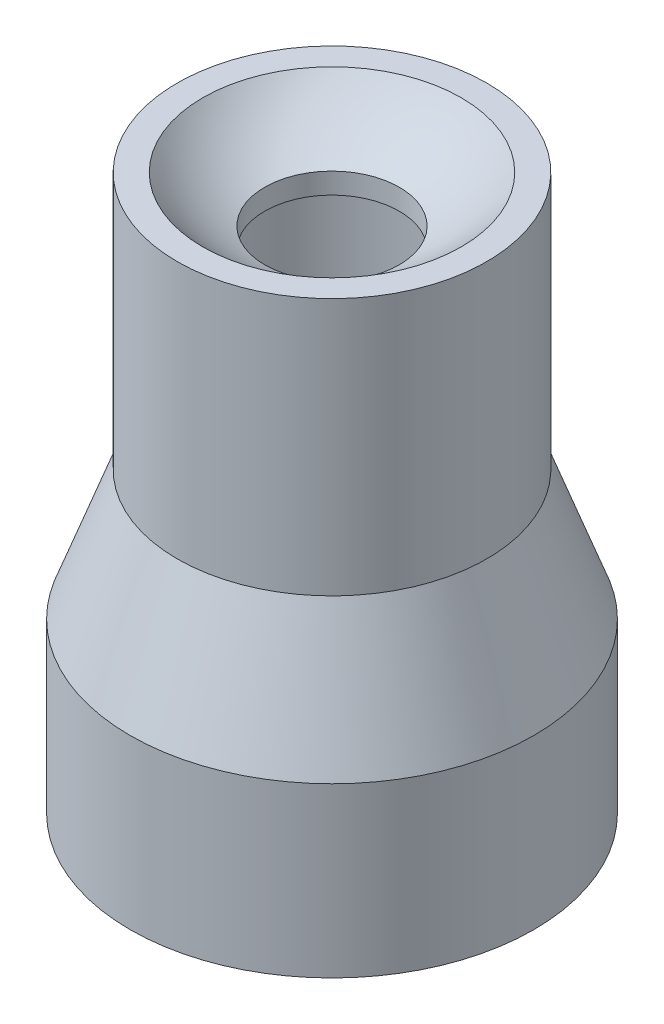
ISO-10303-21;
HEADER;
FILE_DESCRIPTION(('STEP AP214'),'2;1');
FILE_NAME('part.step','',(''),(''),'','','');
FILE_SCHEMA(('AUTOMOTIVE_DESIGN { 1 0 10303 214 1 1 1 1 }'));
ENDSEC;
DATA;
#1=APPLICATION_CONTEXT('core data for automotive mechanical design processes');
#2=APPLICATION_PROTOCOL_DEFINITION('international standard','automotive_design',2000,#1);
#3=PRODUCT_CONTEXT('',#1,'mechanical');
#4=PRODUCT('Part','Part','',(#3));
#5=PRODUCT_RELATED_PRODUCT_CATEGORY('part','',(#4));
#6=PRODUCT_DEFINITION_FORMATION('','',#4);
#7=PRODUCT_DEFINITION_CONTEXT('part definition',#1,'design');
#8=PRODUCT_DEFINITION('design','',#6,#7);
#9=PRODUCT_DEFINITION_SHAPE('','',#8);
#10=(LENGTH_UNIT() NAMED_UNIT(*) SI_UNIT(.MILLI.,.METRE.));
#11=(NAMED_UNIT(*) PLANE_ANGLE_UNIT() SI_UNIT($,.RADIAN.));
#12=(NAMED_UNIT(*) SI_UNIT($,.STERADIAN.) SOLID_ANGLE_UNIT());
#13=UNCERTAINTY_MEASURE_WITH_UNIT(LENGTH_MEASURE(1.E-05),#10,'distance_accuracy_value','');
#14=(GEOMETRIC_REPRESENTATION_CONTEXT(3) GLOBAL_UNCERTAINTY_ASSIGNED_CONTEXT((#13)) GLOBAL_UNIT_ASSIGNED_CONTEXT((#10,
#11,#12)) REPRESENTATION_CONTEXT('',''));
#15=CARTESIAN_POINT('',(0.,0.,0.));
#16=DIRECTION('',(0.,0.,1.));
#17=DIRECTION('',(1.,0.,0.));
#18=AXIS2_PLACEMENT_3D('',#15,#16,#17);
#19=CARTESIAN_POINT('',(0.,14.8,0.));
#20=DIRECTION('',(0.,1.,0.));
#21=DIRECTION('',(0.,0.,1.));
#22=AXIS2_PLACEMENT_3D('',#19,#20,#21);
#23=CYLINDRICAL_SURFACE('',#22,5.);
#24=CARTESIAN_POINT('',(0.,0.,0.));
#25=DIRECTION('',(0.,1.,0.));
#26=DIRECTION('',(0.,0.,1.));
#27=AXIS2_PLACEMENT_3D('',#24,#25,#26);
#28=CIRCLE('',#27,5.);
#29=CARTESIAN_POINT('',(0.,0.,5.));
#30=VERTEX_POINT('',#29);
#31=EDGE_CURVE('E10',#30,#30,#28,.T.);
#32=ORIENTED_EDGE('',*,*,#31,.F.);
#33=EDGE_LOOP('',(#32));
#34=FACE_BOUND('',#33,.T.);
#35=CARTESIAN_POINT('',(0.,5.,0.));
#36=DIRECTION('',(0.,1.,0.));
#37=DIRECTION('',(0.,0.,1.));
#38=AXIS2_PLACEMENT_3D('',#35,#36,#37);
#39=CIRCLE('',#38,5.);
#40=CARTESIAN_POINT('',(0.,5.,5.));
#41=VERTEX_POINT('',#40);
#42=EDGE_CURVE('E67',#41,#41,#39,.T.);
#43=ORIENTED_EDGE('',*,*,#42,.T.);
#44=EDGE_LOOP('',(#43));
#45=FACE_BOUND('',#44,.T.);
#46=ADVANCED_FACE('F30',(#34,#45),#23,.F.);
#47=CARTESIAN_POINT('',(6.,0.,0.));
#48=DIRECTION('',(0.,1.,0.));
#49=DIRECTION('',(0.,0.,1.));
#50=AXIS2_PLACEMENT_3D('',#47,#48,#49);
#51=PLANE('',#50);
#52=CARTESIAN_POINT('',(0.,0.,0.));
#53=DIRECTION('',(0.,1.,0.));
#54=DIRECTION('',(0.,0.,1.));
#55=AXIS2_PLACEMENT_3D('',#52,#53,#54);
#56=CIRCLE('',#55,6.);
#57=CARTESIAN_POINT('',(0.,0.,6.));
#58=VERTEX_POINT('',#57);
#59=EDGE_CURVE('E36',#58,#58,#56,.T.);
#60=ORIENTED_EDGE('',*,*,#59,.F.);
#61=EDGE_LOOP('',(#60));
#62=FACE_BOUND('',#61,.T.);
#63=ORIENTED_EDGE('',*,*,#31,.T.);
#64=EDGE_LOOP('',(#63));
#65=FACE_BOUND('',#64,.T.);
#66=ADVANCED_FACE('F122',(#62,#65),#51,.F.);
#67=CARTESIAN_POINT('',(0.,14.8,0.));
#68=DIRECTION('',(0.,1.,0.));
#69=DIRECTION('',(0.,0.,1.));
#70=AXIS2_PLACEMENT_3D('',#67,#68,#69);
#71=CYLINDRICAL_SURFACE('',#70,6.);
#72=CARTESIAN_POINT('',(0.,5.,0.));
#73=DIRECTION('',(0.,1.,0.));
#74=DIRECTION('',(0.,0.,1.));
#75=AXIS2_PLACEMENT_3D('',#72,#73,#74);
#76=CIRCLE('',#75,6.);
#77=CARTESIAN_POINT('',(0.,5.,6.));
#78=VERTEX_POINT('',#77);
#79=EDGE_CURVE('E40',#78,#78,#76,.T.);
#80=ORIENTED_EDGE('',*,*,#79,.F.);
#81=EDGE_LOOP('',(#80));
#82=FACE_BOUND('',#81,.T.);
#83=ORIENTED_EDGE('',*,*,#59,.T.);
#84=EDGE_LOOP('',(#83));
#85=FACE_BOUND('',#84,.T.);
#86=ADVANCED_FACE('F117',(#82,#85),#71,.T.);
#87=CARTESIAN_POINT('',(0.,5.,0.));
#88=DIRECTION('',(0.,-1.,0.));
#89=DIRECTION('',(0.,0.,-1.));
#90=AXIS2_PLACEMENT_3D('',#87,#88,#89);
#91=CONICAL_SURFACE('',#90,6.,0.349065850398867);
#92=CARTESIAN_POINT('',(0.,8.84646838723646,0.));
#93=DIRECTION('',(0.,1.,0.));
#94=DIRECTION('',(0.,0.,1.));
#95=AXIS2_PLACEMENT_3D('',#92,#93,#94);
#96=CIRCLE('',#95,4.6);
#97=CARTESIAN_POINT('',(0.,8.84646838723646,4.6));
#98=VERTEX_POINT('',#97);
#99=EDGE_CURVE('E44',#98,#98,#96,.T.);
#100=ORIENTED_EDGE('',*,*,#99,.F.);
#101=EDGE_LOOP('',(#100));
#102=FACE_BOUND('',#101,.T.);
#103=ORIENTED_EDGE('',*,*,#79,.T.);
#104=EDGE_LOOP('',(#103));
#105=FACE_BOUND('',#104,.T.);
#106=ADVANCED_FACE('F111',(#102,#105),#91,.T.);
#107=CARTESIAN_POINT('',(0.,14.8,0.));
#108=DIRECTION('',(0.,1.,0.));
#109=DIRECTION('',(0.,0.,1.));
#110=AXIS2_PLACEMENT_3D('',#107,#108,#109);
#111=CYLINDRICAL_SURFACE('',#110,4.6);
#112=CARTESIAN_POINT('',(0.,16.5,0.));
#113=DIRECTION('',(0.,1.,0.));
#114=DIRECTION('',(0.,0.,1.));
#115=AXIS2_PLACEMENT_3D('',#112,#113,#114);
#116=CIRCLE('',#115,4.6);
#117=CARTESIAN_POINT('',(0.,16.5,4.6));
#118=VERTEX_POINT('',#117);
#119=EDGE_CURVE('E49',#118,#118,#116,.T.);
#120=ORIENTED_EDGE('',*,*,#119,.F.);
#121=EDGE_LOOP('',(#120));
#122=FACE_BOUND('',#121,.T.);
#123=ORIENTED_EDGE('',*,*,#99,.T.);
#124=EDGE_LOOP('',(#123));
#125=FACE_BOUND('',#124,.T.);
#126=ADVANCED_FACE('F105',(#122,#125),#111,.T.);
#127=CARTESIAN_POINT('',(4.6,16.5,0.));
#128=DIRECTION('',(0.,-1.,0.));
#129=DIRECTION('',(0.,0.,-1.));
#130=AXIS2_PLACEMENT_3D('',#127,#128,#129);
#131=PLANE('',#130);
#132=CARTESIAN_POINT('',(0.,16.5,0.));
#133=DIRECTION('',(0.,1.,0.));
#134=DIRECTION('',(0.,0.,1.));
#135=AXIS2_PLACEMENT_3D('',#132,#133,#134);
#136=CIRCLE('',#135,3.84187454245971);
#137=CARTESIAN_POINT('',(0.,16.5,3.84187454245971));
#138=VERTEX_POINT('',#137);
#139=EDGE_CURVE('E52',#138,#138,#136,.T.);
#140=ORIENTED_EDGE('',*,*,#139,.F.);
#141=EDGE_LOOP('',(#140));
#142=FACE_BOUND('',#141,.T.);
#143=ORIENTED_EDGE('',*,*,#119,.T.);
#144=EDGE_LOOP('',(#143));
#145=FACE_BOUND('',#144,.T.);
#146=ADVANCED_FACE('F99',(#142,#145),#131,.F.);
#147=CARTESIAN_POINT('',(0.,19.7,0.));
#148=DIRECTION('',(0.,1.,0.));
#149=DIRECTION('',(1.,0.,0.));
#150=AXIS2_PLACEMENT_3D('',#147,#148,#149);
#151=SPHERICAL_SURFACE('',#150,5.);
#152=CARTESIAN_POINT('',(0.,15.1174243050442,0.));
#153=DIRECTION('',(0.,1.,0.));
#154=DIRECTION('',(0.,0.,1.));
#155=AXIS2_PLACEMENT_3D('',#152,#153,#154);
#156=CIRCLE('',#155,2.);
#157=CARTESIAN_POINT('',(0.,15.1174243050442,2.));
#158=VERTEX_POINT('',#157);
#159=EDGE_CURVE('E55',#158,#158,#156,.T.);
#160=ORIENTED_EDGE('',*,*,#159,.F.);
#161=EDGE_LOOP('',(#160));
#162=FACE_BOUND('',#161,.T.);
#163=ORIENTED_EDGE('',*,*,#139,.T.);
#164=EDGE_LOOP('',(#163));
#165=FACE_BOUND('',#164,.T.);
#166=ADVANCED_FACE('F93',(#162,#165),#151,.F.);
#167=CARTESIAN_POINT('',(0.,14.8,0.));
#168=DIRECTION('',(0.,1.,0.));
#169=DIRECTION('',(0.,0.,1.));
#170=AXIS2_PLACEMENT_3D('',#167,#168,#169);
#171=CYLINDRICAL_SURFACE('',#170,2.);
#172=CARTESIAN_POINT('',(0.,14.5,0.));
#173=DIRECTION('',(0.,1.,0.));
#174=DIRECTION('',(0.,0.,1.));
#175=AXIS2_PLACEMENT_3D('',#172,#173,#174);
#176=CIRCLE('',#175,2.);
#177=CARTESIAN_POINT('',(0.,14.5,2.));
#178=VERTEX_POINT('',#177);
#179=EDGE_CURVE('E58',#178,#178,#176,.T.);
#180=ORIENTED_EDGE('',*,*,#179,.F.);
#181=EDGE_LOOP('',(#180));
#182=FACE_BOUND('',#181,.T.);
#183=ORIENTED_EDGE('',*,*,#159,.T.);
#184=EDGE_LOOP('',(#183));
#185=FACE_BOUND('',#184,.T.);
#186=ADVANCED_FACE('F87',(#182,#185),#171,.F.);
#187=CARTESIAN_POINT('',(3.6,14.5,0.));
#188=DIRECTION('',(0.,1.,0.));
#189=DIRECTION('',(0.,0.,1.));
#190=AXIS2_PLACEMENT_3D('',#187,#188,#189);
#191=PLANE('',#190);
#192=CARTESIAN_POINT('',(0.,14.5,0.));
#193=DIRECTION('',(0.,1.,0.));
#194=DIRECTION('',(0.,0.,1.));
#195=AXIS2_PLACEMENT_3D('',#192,#193,#194);
#196=CIRCLE('',#195,3.6);
#197=CARTESIAN_POINT('',(0.,14.5,3.6));
#198=VERTEX_POINT('',#197);
#199=EDGE_CURVE('E61',#198,#198,#196,.T.);
#200=ORIENTED_EDGE('',*,*,#199,.F.);
#201=EDGE_LOOP('',(#200));
#202=FACE_BOUND('',#201,.T.);
#203=ORIENTED_EDGE('',*,*,#179,.T.);
#204=EDGE_LOOP('',(#203));
#205=FACE_BOUND('',#204,.T.);
#206=ADVANCED_FACE('F81',(#202,#205),#191,.F.);
#207=CARTESIAN_POINT('',(0.,14.8,0.));
#208=DIRECTION('',(0.,1.,0.));
#209=DIRECTION('',(0.,0.,1.));
#210=AXIS2_PLACEMENT_3D('',#207,#208,#209);
#211=CYLINDRICAL_SURFACE('',#210,3.6);
#212=CARTESIAN_POINT('',(0.,5.,0.));
#213=DIRECTION('',(0.,1.,0.));
#214=DIRECTION('',(0.,0.,1.));
#215=AXIS2_PLACEMENT_3D('',#212,#213,#214);
#216=CIRCLE('',#215,3.6);
#217=CARTESIAN_POINT('',(0.,5.,3.6));
#218=VERTEX_POINT('',#217);
#219=EDGE_CURVE('E64',#218,#218,#216,.T.);
#220=ORIENTED_EDGE('',*,*,#219,.F.);
#221=EDGE_LOOP('',(#220));
#222=FACE_BOUND('',#221,.T.);
#223=ORIENTED_EDGE('',*,*,#199,.T.);
#224=EDGE_LOOP('',(#223));
#225=FACE_BOUND('',#224,.T.);
#226=ADVANCED_FACE('F75',(#222,#225),#211,.F.);
#227=CARTESIAN_POINT('',(5.,5.,0.));
#228=DIRECTION('',(0.,1.,0.));
#229=DIRECTION('',(0.,0.,1.));
#230=AXIS2_PLACEMENT_3D('',#227,#228,#229);
#231=PLANE('',#230);
#232=ORIENTED_EDGE('',*,*,#42,.F.);
#233=EDGE_LOOP('',(#232));
#234=FACE_BOUND('',#233,.T.);
#235=ORIENTED_EDGE('',*,*,#219,.T.);
#236=EDGE_LOOP('',(#235));
#237=FACE_BOUND('',#236,.T.);
#238=ADVANCED_FACE('F72',(#234,#237),#231,.F.);
#239=CLOSED_SHELL('',(#46,#66,#86,#106,#126,#146,#166,#186,#206,#226,#238));
#240=MANIFOLD_SOLID_BREP('B2',#239);
#241=ADVANCED_BREP_SHAPE_REPRESENTATION('',(#18,#240),#14);
#242=SHAPE_DEFINITION_REPRESENTATION(#9,#241);
ENDSEC;
END-ISO-10303-21;
